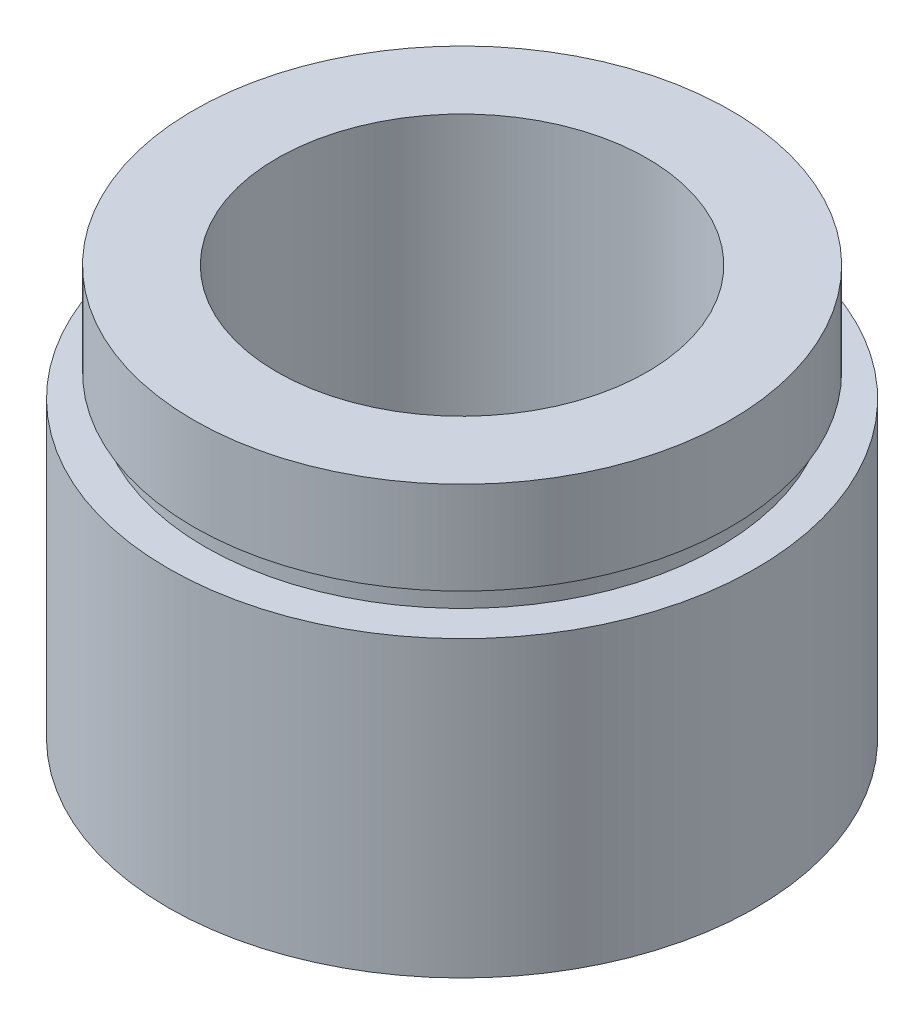
ISO-10303-21;
HEADER;
FILE_DESCRIPTION(('STEP AP214'),'2;1');
FILE_NAME('part.step','',(''),(''),'','','');
FILE_SCHEMA(('AUTOMOTIVE_DESIGN { 1 0 10303 214 1 1 1 1 }'));
ENDSEC;
DATA;
#1=APPLICATION_CONTEXT('core data for automotive mechanical design processes');
#2=APPLICATION_PROTOCOL_DEFINITION('international standard','automotive_design',2000,#1);
#3=PRODUCT_CONTEXT('',#1,'mechanical');
#4=PRODUCT('Part','Part','',(#3));
#5=PRODUCT_RELATED_PRODUCT_CATEGORY('part','',(#4));
#6=PRODUCT_DEFINITION_FORMATION('','',#4);
#7=PRODUCT_DEFINITION_CONTEXT('part definition',#1,'design');
#8=PRODUCT_DEFINITION('design','',#6,#7);
#9=PRODUCT_DEFINITION_SHAPE('','',#8);
#10=(LENGTH_UNIT() NAMED_UNIT(*) SI_UNIT(.MILLI.,.METRE.));
#11=(NAMED_UNIT(*) PLANE_ANGLE_UNIT() SI_UNIT($,.RADIAN.));
#12=(NAMED_UNIT(*) SI_UNIT($,.STERADIAN.) SOLID_ANGLE_UNIT());
#13=UNCERTAINTY_MEASURE_WITH_UNIT(LENGTH_MEASURE(1.E-05),#10,'distance_accuracy_value','');
#14=(GEOMETRIC_REPRESENTATION_CONTEXT(3) GLOBAL_UNCERTAINTY_ASSIGNED_CONTEXT((#13)) GLOBAL_UNIT_ASSIGNED_CONTEXT((#10,
#11,#12)) REPRESENTATION_CONTEXT('',''));
#15=CARTESIAN_POINT('',(0.,0.,0.));
#16=DIRECTION('',(0.,0.,1.));
#17=DIRECTION('',(1.,0.,0.));
#18=AXIS2_PLACEMENT_3D('',#15,#16,#17);
#19=CARTESIAN_POINT('',(11.1,0.,0.));
#20=DIRECTION('',(0.,1.,0.));
#21=DIRECTION('',(0.,0.,1.));
#22=AXIS2_PLACEMENT_3D('',#19,#20,#21);
#23=PLANE('',#22);
#24=CARTESIAN_POINT('',(0.,0.,0.));
#25=DIRECTION('',(0.,1.,0.));
#26=DIRECTION('',(0.,0.,1.));
#27=AXIS2_PLACEMENT_3D('',#24,#25,#26);
#28=CIRCLE('',#27,12.7);
#29=CARTESIAN_POINT('',(0.,0.,12.7));
#30=VERTEX_POINT('',#29);
#31=EDGE_CURVE('E10',#30,#30,#28,.T.);
#32=ORIENTED_EDGE('',*,*,#31,.F.);
#33=EDGE_LOOP('',(#32));
#34=FACE_BOUND('',#33,.T.);
#35=CARTESIAN_POINT('',(0.,0.,0.));
#36=DIRECTION('',(0.,1.,0.));
#37=DIRECTION('',(0.,0.,1.));
#38=AXIS2_PLACEMENT_3D('',#35,#36,#37);
#39=CIRCLE('',#38,11.1);
#40=CARTESIAN_POINT('',(0.,0.,11.1));
#41=VERTEX_POINT('',#40);
#42=EDGE_CURVE('E77',#41,#41,#39,.T.);
#43=ORIENTED_EDGE('',*,*,#42,.T.);
#44=EDGE_LOOP('',(#43));
#45=FACE_BOUND('',#44,.T.);
#46=ADVANCED_FACE('F37',(#34,#45),#23,.F.);
#47=CARTESIAN_POINT('',(0.,161.376166943427,0.));
#48=DIRECTION('',(0.,1.,0.));
#49=DIRECTION('',(0.,0.,1.));
#50=AXIS2_PLACEMENT_3D('',#47,#48,#49);
#51=CYLINDRICAL_SURFACE('',#50,12.7);
#52=CARTESIAN_POINT('',(0.,12.7,0.));
#53=DIRECTION('',(0.,1.,0.));
#54=DIRECTION('',(0.,0.,1.));
#55=AXIS2_PLACEMENT_3D('',#52,#53,#54);
#56=CIRCLE('',#55,12.7);
#57=CARTESIAN_POINT('',(0.,12.7,12.7));
#58=VERTEX_POINT('',#57);
#59=EDGE_CURVE('E43',#58,#58,#56,.T.);
#60=ORIENTED_EDGE('',*,*,#59,.F.);
#61=EDGE_LOOP('',(#60));
#62=FACE_BOUND('',#61,.T.);
#63=ORIENTED_EDGE('',*,*,#31,.T.);
#64=EDGE_LOOP('',(#63));
#65=FACE_BOUND('',#64,.T.);
#66=ADVANCED_FACE('F138',(#62,#65),#51,.T.);
#67=CARTESIAN_POINT('',(12.7,12.7,0.));
#68=DIRECTION('',(0.,-1.,0.));
#69=DIRECTION('',(0.,0.,-1.));
#70=AXIS2_PLACEMENT_3D('',#67,#68,#69);
#71=PLANE('',#70);
#72=CARTESIAN_POINT('',(0.,12.7,0.));
#73=DIRECTION('',(0.,1.,0.));
#74=DIRECTION('',(0.,0.,1.));
#75=AXIS2_PLACEMENT_3D('',#72,#73,#74);
#76=CIRCLE('',#75,11.1);
#77=CARTESIAN_POINT('',(0.,12.7,11.1));
#78=VERTEX_POINT('',#77);
#79=EDGE_CURVE('E47',#78,#78,#76,.T.);
#80=ORIENTED_EDGE('',*,*,#79,.F.);
#81=EDGE_LOOP('',(#80));
#82=FACE_BOUND('',#81,.T.);
#83=ORIENTED_EDGE('',*,*,#59,.T.);
#84=EDGE_LOOP('',(#83));
#85=FACE_BOUND('',#84,.T.);
#86=ADVANCED_FACE('F133',(#82,#85),#71,.F.);
#87=CARTESIAN_POINT('',(0.,161.376166943427,0.));
#88=DIRECTION('',(0.,1.,0.));
#89=DIRECTION('',(0.,0.,1.));
#90=AXIS2_PLACEMENT_3D('',#87,#88,#89);
#91=CYLINDRICAL_SURFACE('',#90,11.1);
#92=CARTESIAN_POINT('',(0.,13.7,0.));
#93=DIRECTION('',(0.,1.,0.));
#94=DIRECTION('',(0.,0.,1.));
#95=AXIS2_PLACEMENT_3D('',#92,#93,#94);
#96=CIRCLE('',#95,11.1);
#97=CARTESIAN_POINT('',(0.,13.7,11.1));
#98=VERTEX_POINT('',#97);
#99=EDGE_CURVE('E51',#98,#98,#96,.T.);
#100=ORIENTED_EDGE('',*,*,#99,.F.);
#101=EDGE_LOOP('',(#100));
#102=FACE_BOUND('',#101,.T.);
#103=ORIENTED_EDGE('',*,*,#79,.T.);
#104=EDGE_LOOP('',(#103));
#105=FACE_BOUND('',#104,.T.);
#106=ADVANCED_FACE('F127',(#102,#105),#91,.T.);
#107=CARTESIAN_POINT('',(11.1,13.7,0.));
#108=DIRECTION('',(0.,1.,0.));
#109=DIRECTION('',(0.,0.,1.));
#110=AXIS2_PLACEMENT_3D('',#107,#108,#109);
#111=PLANE('',#110);
#112=CARTESIAN_POINT('',(0.,13.7,0.));
#113=DIRECTION('',(0.,1.,0.));
#114=DIRECTION('',(0.,0.,1.));
#115=AXIS2_PLACEMENT_3D('',#112,#113,#114);
#116=CIRCLE('',#115,11.6);
#117=CARTESIAN_POINT('',(0.,13.7,11.6));
#118=VERTEX_POINT('',#117);
#119=EDGE_CURVE('E56',#118,#118,#116,.T.);
#120=ORIENTED_EDGE('',*,*,#119,.F.);
#121=EDGE_LOOP('',(#120));
#122=FACE_BOUND('',#121,.T.);
#123=ORIENTED_EDGE('',*,*,#99,.T.);
#124=EDGE_LOOP('',(#123));
#125=FACE_BOUND('',#124,.T.);
#126=ADVANCED_FACE('F121',(#122,#125),#111,.F.);
#127=CARTESIAN_POINT('',(0.,161.376166943427,0.));
#128=DIRECTION('',(0.,1.,0.));
#129=DIRECTION('',(0.,0.,1.));
#130=AXIS2_PLACEMENT_3D('',#127,#128,#129);
#131=CYLINDRICAL_SURFACE('',#130,11.6);
#132=CARTESIAN_POINT('',(0.,17.7,0.));
#133=DIRECTION('',(0.,1.,0.));
#134=DIRECTION('',(0.,0.,1.));
#135=AXIS2_PLACEMENT_3D('',#132,#133,#134);
#136=CIRCLE('',#135,11.6);
#137=CARTESIAN_POINT('',(0.,17.7,11.6));
#138=VERTEX_POINT('',#137);
#139=EDGE_CURVE('E59',#138,#138,#136,.T.);
#140=ORIENTED_EDGE('',*,*,#139,.F.);
#141=EDGE_LOOP('',(#140));
#142=FACE_BOUND('',#141,.T.);
#143=ORIENTED_EDGE('',*,*,#119,.T.);
#144=EDGE_LOOP('',(#143));
#145=FACE_BOUND('',#144,.T.);
#146=ADVANCED_FACE('F115',(#142,#145),#131,.T.);
#147=CARTESIAN_POINT('',(11.6,17.7,0.));
#148=DIRECTION('',(0.,-1.,0.));
#149=DIRECTION('',(0.,0.,-1.));
#150=AXIS2_PLACEMENT_3D('',#147,#148,#149);
#151=PLANE('',#150);
#152=CARTESIAN_POINT('',(0.,17.7,0.));
#153=DIRECTION('',(0.,1.,0.));
#154=DIRECTION('',(0.,0.,1.));
#155=AXIS2_PLACEMENT_3D('',#152,#153,#154);
#156=CIRCLE('',#155,8.00000000000002);
#157=CARTESIAN_POINT('',(0.,17.7,8.00000000000002));
#158=VERTEX_POINT('',#157);
#159=EDGE_CURVE('E62',#158,#158,#156,.T.);
#160=ORIENTED_EDGE('',*,*,#159,.F.);
#161=EDGE_LOOP('',(#160));
#162=FACE_BOUND('',#161,.T.);
#163=ORIENTED_EDGE('',*,*,#139,.T.);
#164=EDGE_LOOP('',(#163));
#165=FACE_BOUND('',#164,.T.);
#166=ADVANCED_FACE('F109',(#162,#165),#151,.F.);
#167=CARTESIAN_POINT('',(0.,161.376166943427,0.));
#168=DIRECTION('',(0.,1.,0.));
#169=DIRECTION('',(0.,0.,1.));
#170=AXIS2_PLACEMENT_3D('',#167,#168,#169);
#171=CYLINDRICAL_SURFACE('',#170,8.00000000000002);
#172=CARTESIAN_POINT('',(0.,5.49999999999998,0.));
#173=DIRECTION('',(0.,1.,0.));
#174=DIRECTION('',(0.,0.,1.));
#175=AXIS2_PLACEMENT_3D('',#172,#173,#174);
#176=CIRCLE('',#175,8.00000000000002);
#177=CARTESIAN_POINT('',(0.,5.49999999999998,8.00000000000002));
#178=VERTEX_POINT('',#177);
#179=EDGE_CURVE('E65',#178,#178,#176,.T.);
#180=ORIENTED_EDGE('',*,*,#179,.F.);
#181=EDGE_LOOP('',(#180));
#182=FACE_BOUND('',#181,.T.);
#183=ORIENTED_EDGE('',*,*,#159,.T.);
#184=EDGE_LOOP('',(#183));
#185=FACE_BOUND('',#184,.T.);
#186=ADVANCED_FACE('F103',(#182,#185),#171,.F.);
#187=CARTESIAN_POINT('',(11.7,5.49999999999998,0.));
#188=DIRECTION('',(0.,1.,0.));
#189=DIRECTION('',(0.,0.,1.));
#190=AXIS2_PLACEMENT_3D('',#187,#188,#189);
#191=PLANE('',#190);
#192=CARTESIAN_POINT('',(0.,5.49999999999998,0.));
#193=DIRECTION('',(0.,1.,0.));
#194=DIRECTION('',(0.,0.,1.));
#195=AXIS2_PLACEMENT_3D('',#192,#193,#194);
#196=CIRCLE('',#195,11.7);
#197=CARTESIAN_POINT('',(0.,5.49999999999998,11.7));
#198=VERTEX_POINT('',#197);
#199=EDGE_CURVE('E68',#198,#198,#196,.T.);
#200=ORIENTED_EDGE('',*,*,#199,.F.);
#201=EDGE_LOOP('',(#200));
#202=FACE_BOUND('',#201,.T.);
#203=ORIENTED_EDGE('',*,*,#179,.T.);
#204=EDGE_LOOP('',(#203));
#205=FACE_BOUND('',#204,.T.);
#206=ADVANCED_FACE('F97',(#202,#205),#191,.F.);
#207=CARTESIAN_POINT('',(0.,161.376166943427,0.));
#208=DIRECTION('',(0.,1.,0.));
#209=DIRECTION('',(0.,0.,1.));
#210=AXIS2_PLACEMENT_3D('',#207,#208,#209);
#211=CYLINDRICAL_SURFACE('',#210,11.7);
#212=CARTESIAN_POINT('',(0.,4.49999999999998,0.));
#213=DIRECTION('',(0.,1.,0.));
#214=DIRECTION('',(0.,0.,1.));
#215=AXIS2_PLACEMENT_3D('',#212,#213,#214);
#216=CIRCLE('',#215,11.7);
#217=CARTESIAN_POINT('',(0.,4.49999999999998,11.7));
#218=VERTEX_POINT('',#217);
#219=EDGE_CURVE('E71',#218,#218,#216,.T.);
#220=ORIENTED_EDGE('',*,*,#219,.F.);
#221=EDGE_LOOP('',(#220));
#222=FACE_BOUND('',#221,.T.);
#223=ORIENTED_EDGE('',*,*,#199,.T.);
#224=EDGE_LOOP('',(#223));
#225=FACE_BOUND('',#224,.T.);
#226=ADVANCED_FACE('F91',(#222,#225),#211,.F.);
#227=CARTESIAN_POINT('',(11.1,4.49999999999998,0.));
#228=DIRECTION('',(0.,-1.,0.));
#229=DIRECTION('',(0.,0.,-1.));
#230=AXIS2_PLACEMENT_3D('',#227,#228,#229);
#231=PLANE('',#230);
#232=CARTESIAN_POINT('',(0.,4.49999999999998,0.));
#233=DIRECTION('',(0.,1.,0.));
#234=DIRECTION('',(0.,0.,1.));
#235=AXIS2_PLACEMENT_3D('',#232,#233,#234);
#236=CIRCLE('',#235,11.1);
#237=CARTESIAN_POINT('',(0.,4.49999999999998,11.1));
#238=VERTEX_POINT('',#237);
#239=EDGE_CURVE('E74',#238,#238,#236,.T.);
#240=ORIENTED_EDGE('',*,*,#239,.F.);
#241=EDGE_LOOP('',(#240));
#242=FACE_BOUND('',#241,.T.);
#243=ORIENTED_EDGE('',*,*,#219,.T.);
#244=EDGE_LOOP('',(#243));
#245=FACE_BOUND('',#244,.T.);
#246=ADVANCED_FACE('F85',(#242,#245),#231,.F.);
#247=CARTESIAN_POINT('',(0.,161.376166943427,0.));
#248=DIRECTION('',(0.,1.,0.));
#249=DIRECTION('',(0.,0.,1.));
#250=AXIS2_PLACEMENT_3D('',#247,#248,#249);
#251=CYLINDRICAL_SURFACE('',#250,11.1);
#252=ORIENTED_EDGE('',*,*,#42,.F.);
#253=EDGE_LOOP('',(#252));
#254=FACE_BOUND('',#253,.T.);
#255=ORIENTED_EDGE('',*,*,#239,.T.);
#256=EDGE_LOOP('',(#255));
#257=FACE_BOUND('',#256,.T.);
#258=ADVANCED_FACE('F82',(#254,#257),#251,.F.);
#259=CLOSED_SHELL('',(#46,#66,#86,#106,#126,#146,#166,#186,#206,#226,#246,#258));
#260=MANIFOLD_SOLID_BREP('B2',#259);
#261=ADVANCED_BREP_SHAPE_REPRESENTATION('',(#18,#260),#14);
#262=SHAPE_DEFINITION_REPRESENTATION(#9,#261);
ENDSEC;
END-ISO-10303-21;
